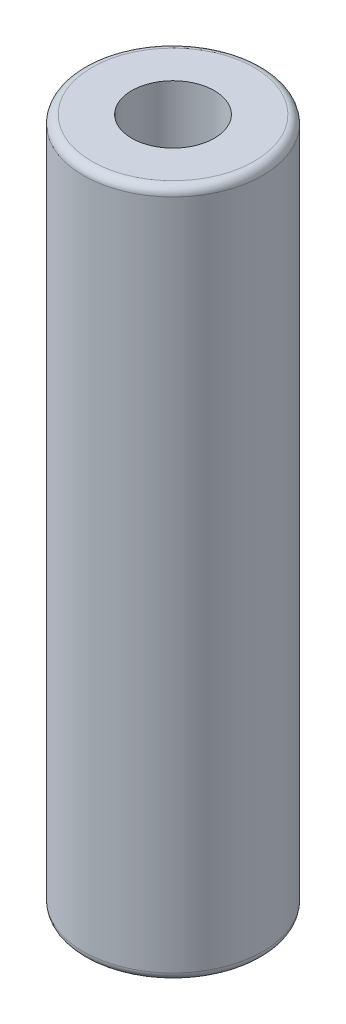
ISO-10303-21;
HEADER;
FILE_DESCRIPTION(('STEP AP214'),'2;1');
FILE_NAME('part.step','',(''),(''),'','','');
FILE_SCHEMA(('AUTOMOTIVE_DESIGN { 1 0 10303 214 1 1 1 1 }'));
ENDSEC;
DATA;
#1=APPLICATION_CONTEXT('core data for automotive mechanical design processes');
#2=APPLICATION_PROTOCOL_DEFINITION('international standard','automotive_design',2000,#1);
#3=PRODUCT_CONTEXT('',#1,'mechanical');
#4=PRODUCT('Part','Part','',(#3));
#5=PRODUCT_RELATED_PRODUCT_CATEGORY('part','',(#4));
#6=PRODUCT_DEFINITION_FORMATION('','',#4);
#7=PRODUCT_DEFINITION_CONTEXT('part definition',#1,'design');
#8=PRODUCT_DEFINITION('design','',#6,#7);
#9=PRODUCT_DEFINITION_SHAPE('','',#8);
#10=(LENGTH_UNIT() NAMED_UNIT(*) SI_UNIT(.MILLI.,.METRE.));
#11=(NAMED_UNIT(*) PLANE_ANGLE_UNIT() SI_UNIT($,.RADIAN.));
#12=(NAMED_UNIT(*) SI_UNIT($,.STERADIAN.) SOLID_ANGLE_UNIT());
#13=UNCERTAINTY_MEASURE_WITH_UNIT(LENGTH_MEASURE(1.E-05),#10,'distance_accuracy_value','');
#14=(GEOMETRIC_REPRESENTATION_CONTEXT(3) GLOBAL_UNCERTAINTY_ASSIGNED_CONTEXT((#13)) GLOBAL_UNIT_ASSIGNED_CONTEXT((#10,
#11,#12)) REPRESENTATION_CONTEXT('',''));
#15=CARTESIAN_POINT('',(0.,0.,0.));
#16=DIRECTION('',(0.,0.,1.));
#17=DIRECTION('',(1.,0.,0.));
#18=AXIS2_PLACEMENT_3D('',#15,#16,#17);
#19=CARTESIAN_POINT('',(0.,25.,0.));
#20=DIRECTION('',(0.,-1.,0.));
#21=DIRECTION('',(0.,0.,-1.));
#22=AXIS2_PLACEMENT_3D('',#19,#20,#21);
#23=CYLINDRICAL_SURFACE('',#22,3.25);
#24=CARTESIAN_POINT('',(0.,0.300000000000002,0.));
#25=DIRECTION('',(0.,1.,0.));
#26=DIRECTION('',(0.,0.,1.));
#27=AXIS2_PLACEMENT_3D('',#24,#25,#26);
#28=CIRCLE('',#27,3.25);
#29=CARTESIAN_POINT('',(0.,0.300000000000002,3.25));
#30=VERTEX_POINT('',#29);
#31=EDGE_CURVE('E41',#30,#30,#28,.T.);
#32=ORIENTED_EDGE('',*,*,#31,.T.);
#33=EDGE_LOOP('',(#32));
#34=FACE_BOUND('',#33,.T.);
#35=CARTESIAN_POINT('',(0.,24.7,0.));
#36=DIRECTION('',(0.,1.,0.));
#37=DIRECTION('',(0.,0.,1.));
#38=AXIS2_PLACEMENT_3D('',#35,#36,#37);
#39=CIRCLE('',#38,3.25);
#40=CARTESIAN_POINT('',(0.,24.7,3.25));
#41=VERTEX_POINT('',#40);
#42=EDGE_CURVE('E45',#41,#41,#39,.F.);
#43=ORIENTED_EDGE('',*,*,#42,.T.);
#44=EDGE_LOOP('',(#43));
#45=FACE_BOUND('',#44,.T.);
#46=ADVANCED_FACE('F30',(#34,#45),#23,.T.);
#47=CARTESIAN_POINT('',(0.,25.,0.));
#48=DIRECTION('',(0.,1.,0.));
#49=DIRECTION('',(0.,0.,1.));
#50=AXIS2_PLACEMENT_3D('',#47,#48,#49);
#51=PLANE('',#50);
#52=CARTESIAN_POINT('',(0.,25.,0.));
#53=DIRECTION('',(0.,1.,0.));
#54=DIRECTION('',(0.,0.,1.));
#55=AXIS2_PLACEMENT_3D('',#52,#53,#54);
#56=CIRCLE('',#55,2.95);
#57=CARTESIAN_POINT('',(0.,25.,2.95));
#58=VERTEX_POINT('',#57);
#59=EDGE_CURVE('E10',#58,#58,#56,.T.);
#60=ORIENTED_EDGE('',*,*,#59,.T.);
#61=EDGE_LOOP('',(#60));
#62=FACE_BOUND('',#61,.T.);
#63=CARTESIAN_POINT('',(0.,25.,0.));
#64=DIRECTION('',(0.,1.,0.));
#65=DIRECTION('',(0.,0.,1.));
#66=AXIS2_PLACEMENT_3D('',#63,#64,#65);
#67=CIRCLE('',#66,1.5);
#68=CARTESIAN_POINT('',(0.,25.,1.5));
#69=VERTEX_POINT('',#68);
#70=EDGE_CURVE('E51',#69,#69,#67,.T.);
#71=ORIENTED_EDGE('',*,*,#70,.F.);
#72=EDGE_LOOP('',(#71));
#73=FACE_BOUND('',#72,.T.);
#74=ADVANCED_FACE('F66',(#62,#73),#51,.T.);
#75=CARTESIAN_POINT('',(0.,0.,0.));
#76=DIRECTION('',(0.,1.,0.));
#77=DIRECTION('',(0.,0.,1.));
#78=AXIS2_PLACEMENT_3D('',#75,#76,#77);
#79=PLANE('',#78);
#80=CARTESIAN_POINT('',(0.,0.,0.));
#81=DIRECTION('',(0.,1.,0.));
#82=DIRECTION('',(0.,0.,1.));
#83=AXIS2_PLACEMENT_3D('',#80,#81,#82);
#84=CIRCLE('',#83,2.95);
#85=CARTESIAN_POINT('',(0.,0.,2.95));
#86=VERTEX_POINT('',#85);
#87=EDGE_CURVE('E37',#86,#86,#84,.F.);
#88=ORIENTED_EDGE('',*,*,#87,.T.);
#89=EDGE_LOOP('',(#88));
#90=FACE_BOUND('',#89,.T.);
#91=CARTESIAN_POINT('',(0.,0.,0.));
#92=DIRECTION('',(0.,1.,0.));
#93=DIRECTION('',(0.,0.,1.));
#94=AXIS2_PLACEMENT_3D('',#91,#92,#93);
#95=CIRCLE('',#94,1.5);
#96=CARTESIAN_POINT('',(0.,0.,1.5));
#97=VERTEX_POINT('',#96);
#98=EDGE_CURVE('E50',#97,#97,#95,.T.);
#99=ORIENTED_EDGE('',*,*,#98,.T.);
#100=EDGE_LOOP('',(#99));
#101=FACE_BOUND('',#100,.T.);
#102=ADVANCED_FACE('F57',(#90,#101),#79,.F.);
#103=CARTESIAN_POINT('',(0.,0.,0.));
#104=DIRECTION('',(0.,1.,0.));
#105=DIRECTION('',(0.,0.,1.));
#106=AXIS2_PLACEMENT_3D('',#103,#104,#105);
#107=CYLINDRICAL_SURFACE('',#106,1.5);
#108=ORIENTED_EDGE('',*,*,#98,.F.);
#109=EDGE_LOOP('',(#108));
#110=FACE_BOUND('',#109,.T.);
#111=ORIENTED_EDGE('',*,*,#70,.T.);
#112=EDGE_LOOP('',(#111));
#113=FACE_BOUND('',#112,.T.);
#114=ADVANCED_FACE('F59',(#110,#113),#107,.F.);
#115=CARTESIAN_POINT('',(0.,0.300000000000002,0.));
#116=DIRECTION('',(0.,1.,0.));
#117=DIRECTION('',(0.,0.,1.));
#118=AXIS2_PLACEMENT_3D('',#115,#116,#117);
#119=TOROIDAL_SURFACE('',#118,2.95,0.3);
#120=ORIENTED_EDGE('',*,*,#87,.F.);
#121=EDGE_LOOP('',(#120));
#122=FACE_BOUND('',#121,.T.);
#123=ORIENTED_EDGE('',*,*,#31,.F.);
#124=EDGE_LOOP('',(#123));
#125=FACE_BOUND('',#124,.T.);
#126=ADVANCED_FACE('F62',(#122,#125),#119,.T.);
#127=CARTESIAN_POINT('',(0.,24.7,0.));
#128=DIRECTION('',(0.,1.,0.));
#129=DIRECTION('',(0.,0.,1.));
#130=AXIS2_PLACEMENT_3D('',#127,#128,#129);
#131=TOROIDAL_SURFACE('',#130,2.95,0.3);
#132=ORIENTED_EDGE('',*,*,#42,.F.);
#133=EDGE_LOOP('',(#132));
#134=FACE_BOUND('',#133,.T.);
#135=ORIENTED_EDGE('',*,*,#59,.F.);
#136=EDGE_LOOP('',(#135));
#137=FACE_BOUND('',#136,.T.);
#138=ADVANCED_FACE('F32',(#134,#137),#131,.T.);
#139=CLOSED_SHELL('',(#46,#74,#102,#114,#126,#138));
#140=MANIFOLD_SOLID_BREP('B2',#139);
#141=ADVANCED_BREP_SHAPE_REPRESENTATION('',(#18,#140),#14);
#142=SHAPE_DEFINITION_REPRESENTATION(#9,#141);
ENDSEC;
END-ISO-10303-21;
